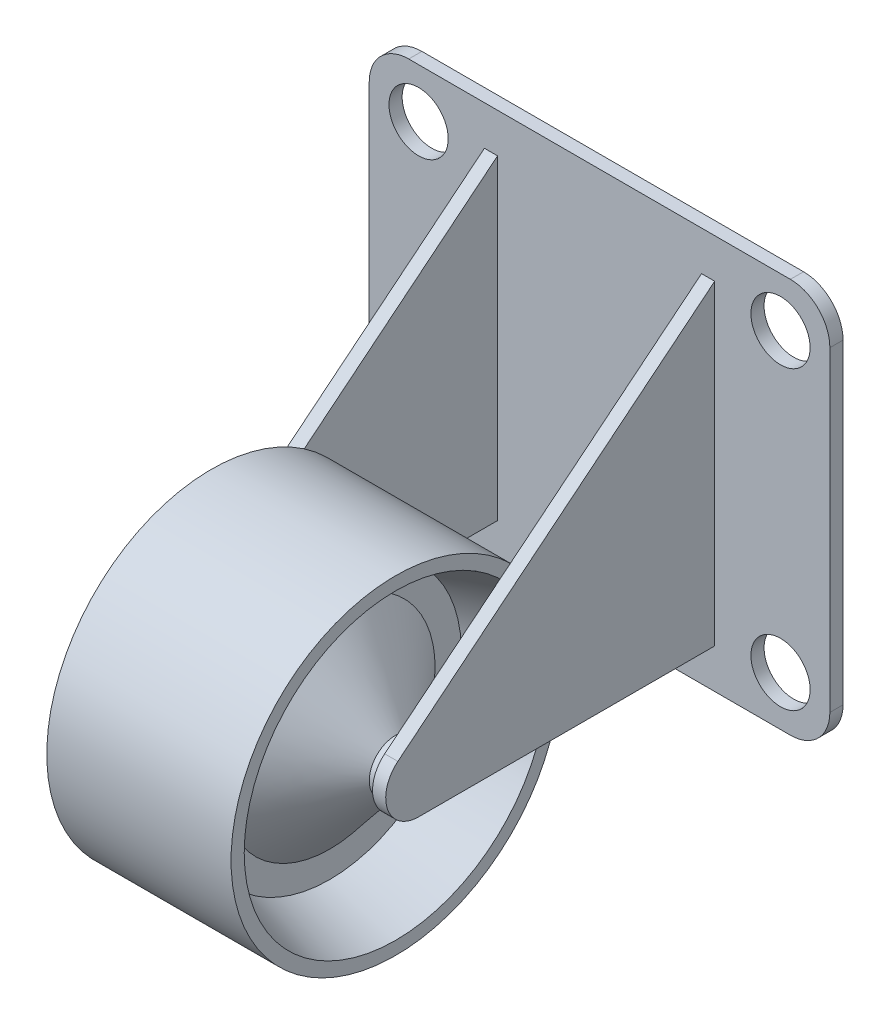
ISO-10303-21;
HEADER;
FILE_DESCRIPTION(('STEP AP214'),'2;1');
FILE_NAME('part.step','',(''),(''),'','','');
FILE_SCHEMA(('AUTOMOTIVE_DESIGN { 1 0 10303 214 1 1 1 1 }'));
ENDSEC;
DATA;
#1=APPLICATION_CONTEXT('core data for automotive mechanical design processes');
#2=APPLICATION_PROTOCOL_DEFINITION('international standard','automotive_design',2000,#1);
#3=PRODUCT_CONTEXT('',#1,'mechanical');
#4=PRODUCT('Part','Part','',(#3));
#5=PRODUCT_RELATED_PRODUCT_CATEGORY('part','',(#4));
#6=PRODUCT_DEFINITION_FORMATION('','',#4);
#7=PRODUCT_DEFINITION_CONTEXT('part definition',#1,'design');
#8=PRODUCT_DEFINITION('design','',#6,#7);
#9=PRODUCT_DEFINITION_SHAPE('','',#8);
#10=(LENGTH_UNIT() NAMED_UNIT(*) SI_UNIT(.MILLI.,.METRE.));
#11=(NAMED_UNIT(*) PLANE_ANGLE_UNIT() SI_UNIT($,.RADIAN.));
#12=(NAMED_UNIT(*) SI_UNIT($,.STERADIAN.) SOLID_ANGLE_UNIT());
#13=UNCERTAINTY_MEASURE_WITH_UNIT(LENGTH_MEASURE(1.E-05),#10,'distance_accuracy_value','');
#14=(GEOMETRIC_REPRESENTATION_CONTEXT(3) GLOBAL_UNCERTAINTY_ASSIGNED_CONTEXT((#13)) GLOBAL_UNIT_ASSIGNED_CONTEXT((#10,
#11,#12)) REPRESENTATION_CONTEXT('',''));
#15=CARTESIAN_POINT('',(0.,0.,0.));
#16=DIRECTION('',(0.,0.,1.));
#17=DIRECTION('',(1.,0.,0.));
#18=AXIS2_PLACEMENT_3D('',#15,#16,#17);
#19=CARTESIAN_POINT('',(-500000.,-24.5,23.5));
#20=DIRECTION('',(1.,0.,0.));
#21=DIRECTION('',(0.,0.,-1.));
#22=AXIS2_PLACEMENT_3D('',#19,#20,#21);
#23=CYLINDRICAL_SURFACE('',#22,2.);
#24=CARTESIAN_POINT('',(9.74999999999682,-24.5,23.5));
#25=DIRECTION('',(1.,0.,0.));
#26=DIRECTION('',(0.,0.,-1.));
#27=AXIS2_PLACEMENT_3D('',#24,#25,#26);
#28=CIRCLE('',#27,2.);
#29=CARTESIAN_POINT('',(9.74999999999682,-24.5,21.5));
#30=VERTEX_POINT('',#29);
#31=EDGE_CURVE('E203',#30,#30,#28,.T.);
#32=ORIENTED_EDGE('',*,*,#31,.T.);
#33=EDGE_LOOP('',(#32));
#34=FACE_BOUND('',#33,.T.);
#35=CARTESIAN_POINT('',(10.4999999999791,-24.5,23.5));
#36=DIRECTION('',(-1.,0.,0.));
#37=DIRECTION('',(0.,-1.,0.));
#38=AXIS2_PLACEMENT_3D('',#35,#36,#37);
#39=CIRCLE('',#38,2.);
#40=CARTESIAN_POINT('',(10.4999999999791,-26.5,23.5));
#41=VERTEX_POINT('',#40);
#42=EDGE_CURVE('E599',#41,#41,#39,.T.);
#43=ORIENTED_EDGE('',*,*,#42,.T.);
#44=EDGE_LOOP('',(#43));
#45=FACE_BOUND('',#44,.T.);
#46=ADVANCED_FACE('F64',(#34,#45),#23,.T.);
#47=CARTESIAN_POINT('',(9.75,-30.,26.));
#48=DIRECTION('',(1.,0.,0.));
#49=DIRECTION('',(0.,0.,-1.));
#50=AXIS2_PLACEMENT_3D('',#47,#48,#49);
#51=PLANE('',#50);
#52=CARTESIAN_POINT('',(9.75,-24.5,23.5));
#53=DIRECTION('',(1.,0.,0.));
#54=DIRECTION('',(0.,0.,-1.));
#55=AXIS2_PLACEMENT_3D('',#52,#53,#54);
#56=CIRCLE('',#55,2.49999999999999);
#57=CARTESIAN_POINT('',(9.75,-22.559619304037,25.0763637761424));
#58=VERTEX_POINT('',#57);
#59=CARTESIAN_POINT('',(9.75,-27.,23.5));
#60=VERTEX_POINT('',#59);
#61=EDGE_CURVE('E232',#58,#60,#56,.T.);
#62=ORIENTED_EDGE('',*,*,#61,.T.);
#63=DIRECTION('',(0.,0.,1.));
#64=VECTOR('',#63,1.);
#65=CARTESIAN_POINT('',(9.75,-27.,26.));
#66=LINE('',#65,#64);
#67=CARTESIAN_POINT('',(9.75,-27.,0.999999999999997));
#68=VERTEX_POINT('',#67);
#69=EDGE_CURVE('E195',#68,#60,#66,.T.);
#70=ORIENTED_EDGE('',*,*,#69,.F.);
#71=DIRECTION('',(0.,1.,0.));
#72=VECTOR('',#71,1.);
#73=CARTESIAN_POINT('',(9.75,-30.,0.999999999999999));
#74=LINE('',#73,#72);
#75=CARTESIAN_POINT('',(9.75,-2.99999999999999,0.999999999999997));
#76=VERTEX_POINT('',#75);
#77=EDGE_CURVE('E68',#68,#76,#74,.T.);
#78=ORIENTED_EDGE('',*,*,#77,.T.);
#79=DIRECTION('',(0.,0.630545510456978,-0.776152278385208));
#80=VECTOR('',#79,1.);
#81=CARTESIAN_POINT('',(9.75,-25.9698496646198,29.2740910143659));
#82=LINE('',#81,#80);
#83=EDGE_CURVE('E226',#58,#76,#82,.T.);
#84=ORIENTED_EDGE('',*,*,#83,.F.);
#85=EDGE_LOOP('',(#62,#70,#78,#84));
#86=FACE_BOUND('',#85,.T.);
#87=ORIENTED_EDGE('',*,*,#31,.F.);
#88=EDGE_LOOP('',(#87));
#89=FACE_BOUND('',#88,.T.);
#90=ADVANCED_FACE('F352',(#86,#89),#51,.T.);
#91=CARTESIAN_POINT('',(25.25,-30.,0.999999999999999));
#92=DIRECTION('',(-1.,0.,0.));
#93=DIRECTION('',(0.,0.,1.));
#94=AXIS2_PLACEMENT_3D('',#91,#92,#93);
#95=PLANE('',#94);
#96=DIRECTION('',(0.,0.,-1.));
#97=VECTOR('',#96,1.);
#98=CARTESIAN_POINT('',(25.25,-27.,1.));
#99=LINE('',#98,#97);
#100=CARTESIAN_POINT('',(25.25,-27.,23.5));
#101=VERTEX_POINT('',#100);
#102=CARTESIAN_POINT('',(25.25,-27.,0.999999999999997));
#103=VERTEX_POINT('',#102);
#104=EDGE_CURVE('E207',#101,#103,#99,.T.);
#105=ORIENTED_EDGE('',*,*,#104,.F.);
#106=CARTESIAN_POINT('',(25.25,-24.5,23.5));
#107=DIRECTION('',(-1.,0.,0.));
#108=DIRECTION('',(0.,0.,1.));
#109=AXIS2_PLACEMENT_3D('',#106,#107,#108);
#110=CIRCLE('',#109,2.49999999999999);
#111=CARTESIAN_POINT('',(25.25,-22.559619304037,25.0763637761424));
#112=VERTEX_POINT('',#111);
#113=EDGE_CURVE('E12',#101,#112,#110,.T.);
#114=ORIENTED_EDGE('',*,*,#113,.T.);
#115=DIRECTION('',(0.,-0.630545510456978,0.776152278385208));
#116=VECTOR('',#115,1.);
#117=CARTESIAN_POINT('',(25.25,-13.7348663004512,14.2137820333022));
#118=LINE('',#117,#116);
#119=CARTESIAN_POINT('',(25.25,-3.,0.999999999999998));
#120=VERTEX_POINT('',#119);
#121=EDGE_CURVE('E74',#120,#112,#118,.T.);
#122=ORIENTED_EDGE('',*,*,#121,.F.);
#123=DIRECTION('',(0.,1.,0.));
#124=VECTOR('',#123,1.);
#125=CARTESIAN_POINT('',(25.25,-30.,0.999999999999999));
#126=LINE('',#125,#124);
#127=EDGE_CURVE('E90',#103,#120,#126,.T.);
#128=ORIENTED_EDGE('',*,*,#127,.F.);
#129=EDGE_LOOP('',(#105,#114,#122,#128));
#130=FACE_BOUND('',#129,.T.);
#131=CARTESIAN_POINT('',(25.25,-24.5,23.5));
#132=DIRECTION('',(-1.,0.,0.));
#133=DIRECTION('',(0.,0.,1.));
#134=AXIS2_PLACEMENT_3D('',#131,#132,#133);
#135=CIRCLE('',#134,2.);
#136=CARTESIAN_POINT('',(25.25,-24.5,25.5));
#137=VERTEX_POINT('',#136);
#138=EDGE_CURVE('E412',#137,#137,#135,.T.);
#139=ORIENTED_EDGE('',*,*,#138,.F.);
#140=EDGE_LOOP('',(#139));
#141=FACE_BOUND('',#140,.T.);
#142=ADVANCED_FACE('F389',(#130,#141),#95,.T.);
#143=CARTESIAN_POINT('',(8.75,-30.,0.999999999999999));
#144=DIRECTION('',(-1.,0.,0.));
#145=DIRECTION('',(0.,0.,1.));
#146=AXIS2_PLACEMENT_3D('',#143,#144,#145);
#147=PLANE('',#146);
#148=DIRECTION('',(0.,0.,-1.));
#149=VECTOR('',#148,1.);
#150=CARTESIAN_POINT('',(8.75,-27.,1.));
#151=LINE('',#150,#149);
#152=CARTESIAN_POINT('',(8.75,-27.,23.5));
#153=VERTEX_POINT('',#152);
#154=CARTESIAN_POINT('',(8.75,-27.,0.999999999999997));
#155=VERTEX_POINT('',#154);
#156=EDGE_CURVE('E210',#153,#155,#151,.T.);
#157=ORIENTED_EDGE('',*,*,#156,.F.);
#158=CARTESIAN_POINT('',(8.75,-24.5,23.5));
#159=DIRECTION('',(-1.,0.,0.));
#160=DIRECTION('',(0.,0.,1.));
#161=AXIS2_PLACEMENT_3D('',#158,#159,#160);
#162=CIRCLE('',#161,2.49999999999999);
#163=CARTESIAN_POINT('',(8.75,-22.559619304037,25.0763637761424));
#164=VERTEX_POINT('',#163);
#165=EDGE_CURVE('E229',#153,#164,#162,.T.);
#166=ORIENTED_EDGE('',*,*,#165,.T.);
#167=DIRECTION('',(0.,-0.630545510456978,0.776152278385208));
#168=VECTOR('',#167,1.);
#169=CARTESIAN_POINT('',(8.75,-13.7348663004512,14.2137820333022));
#170=LINE('',#169,#168);
#171=CARTESIAN_POINT('',(8.75,-3.,0.999999999999999));
#172=VERTEX_POINT('',#171);
#173=EDGE_CURVE('E224',#172,#164,#170,.T.);
#174=ORIENTED_EDGE('',*,*,#173,.F.);
#175=DIRECTION('',(0.,1.,0.));
#176=VECTOR('',#175,1.);
#177=CARTESIAN_POINT('',(8.75,-30.,0.999999999999999));
#178=LINE('',#177,#176);
#179=EDGE_CURVE('E82',#155,#172,#178,.T.);
#180=ORIENTED_EDGE('',*,*,#179,.F.);
#181=EDGE_LOOP('',(#157,#166,#174,#180));
#182=FACE_BOUND('',#181,.T.);
#183=ADVANCED_FACE('F428',(#182),#147,.T.);
#184=CARTESIAN_POINT('',(26.25,-30.,26.));
#185=DIRECTION('',(1.,0.,0.));
#186=DIRECTION('',(0.,0.,-1.));
#187=AXIS2_PLACEMENT_3D('',#184,#185,#186);
#188=PLANE('',#187);
#189=CARTESIAN_POINT('',(26.25,-24.5,23.5));
#190=DIRECTION('',(1.,0.,0.));
#191=DIRECTION('',(0.,0.,-1.));
#192=AXIS2_PLACEMENT_3D('',#189,#190,#191);
#193=CIRCLE('',#192,2.49999999999999);
#194=CARTESIAN_POINT('',(26.25,-22.559619304037,25.0763637761424));
#195=VERTEX_POINT('',#194);
#196=CARTESIAN_POINT('',(26.25,-27.,23.5));
#197=VERTEX_POINT('',#196);
#198=EDGE_CURVE('E185',#195,#197,#193,.T.);
#199=ORIENTED_EDGE('',*,*,#198,.T.);
#200=DIRECTION('',(0.,0.,1.));
#201=VECTOR('',#200,1.);
#202=CARTESIAN_POINT('',(26.25,-27.,0.));
#203=LINE('',#202,#201);
#204=CARTESIAN_POINT('',(26.25,-27.,0.999999999999997));
#205=VERTEX_POINT('',#204);
#206=EDGE_CURVE('E189',#205,#197,#203,.T.);
#207=ORIENTED_EDGE('',*,*,#206,.F.);
#208=DIRECTION('',(0.,1.,0.));
#209=VECTOR('',#208,1.);
#210=CARTESIAN_POINT('',(26.25,-30.,0.999999999999997));
#211=LINE('',#210,#209);
#212=CARTESIAN_POINT('',(26.25,-2.99999999999999,0.999999999999997));
#213=VERTEX_POINT('',#212);
#214=EDGE_CURVE('E234',#205,#213,#211,.T.);
#215=ORIENTED_EDGE('',*,*,#214,.T.);
#216=DIRECTION('',(0.,0.630545510456978,-0.776152278385208));
#217=VECTOR('',#216,1.);
#218=CARTESIAN_POINT('',(26.25,-1.3178377431609,-1.07061036294279));
#219=LINE('',#218,#217);
#220=EDGE_CURVE('E192',#195,#213,#219,.T.);
#221=ORIENTED_EDGE('',*,*,#220,.F.);
#222=EDGE_LOOP('',(#199,#207,#215,#221));
#223=FACE_BOUND('',#222,.T.);
#224=ADVANCED_FACE('F187',(#223),#188,.T.);
#225=CARTESIAN_POINT('',(0.,0.,1.));
#226=DIRECTION('',(1.,0.,0.));
#227=DIRECTION('',(0.,0.,-1.));
#228=AXIS2_PLACEMENT_3D('',#225,#226,#227);
#229=PLANE('',#228);
#230=DIRECTION('',(0.,-1.,0.));
#231=VECTOR('',#230,1.);
#232=CARTESIAN_POINT('',(0.,0.,0.));
#233=LINE('',#232,#231);
#234=CARTESIAN_POINT('',(0.,-3.,0.));
#235=VERTEX_POINT('',#234);
#236=CARTESIAN_POINT('',(0.,-27.,0.));
#237=VERTEX_POINT('',#236);
#238=EDGE_CURVE('E256',#235,#237,#233,.T.);
#239=ORIENTED_EDGE('',*,*,#238,.T.);
#240=DIRECTION('',(0.,0.,-1.));
#241=VECTOR('',#240,1.);
#242=CARTESIAN_POINT('',(0.,-27.,1.));
#243=LINE('',#242,#241);
#244=CARTESIAN_POINT('',(0.,-27.,1.));
#245=VERTEX_POINT('',#244);
#246=EDGE_CURVE('E286',#237,#245,#243,.F.);
#247=ORIENTED_EDGE('',*,*,#246,.T.);
#248=DIRECTION('',(0.,-1.,0.));
#249=VECTOR('',#248,1.);
#250=CARTESIAN_POINT('',(0.,0.,1.));
#251=LINE('',#250,#249);
#252=CARTESIAN_POINT('',(0.,-3.,1.));
#253=VERTEX_POINT('',#252);
#254=EDGE_CURVE('E269',#253,#245,#251,.T.);
#255=ORIENTED_EDGE('',*,*,#254,.F.);
#256=DIRECTION('',(0.,0.,-1.));
#257=VECTOR('',#256,1.);
#258=CARTESIAN_POINT('',(0.,-3.,1.));
#259=LINE('',#258,#257);
#260=EDGE_CURVE('E283',#253,#235,#259,.T.);
#261=ORIENTED_EDGE('',*,*,#260,.T.);
#262=EDGE_LOOP('',(#239,#247,#255,#261));
#263=FACE_BOUND('',#262,.T.);
#264=ADVANCED_FACE('F321',(#263),#229,.F.);
#265=CARTESIAN_POINT('',(0.,-30.,1.));
#266=DIRECTION('',(0.,1.,0.));
#267=DIRECTION('',(0.,0.,1.));
#268=AXIS2_PLACEMENT_3D('',#265,#266,#267);
#269=PLANE('',#268);
#270=DIRECTION('',(0.,0.,-1.));
#271=VECTOR('',#270,1.);
#272=CARTESIAN_POINT('',(32.,-30.,1.));
#273=LINE('',#272,#271);
#274=CARTESIAN_POINT('',(32.,-30.,0.));
#275=VERTEX_POINT('',#274);
#276=CARTESIAN_POINT('',(32.,-30.,1.));
#277=VERTEX_POINT('',#276);
#278=EDGE_CURVE('E248',#275,#277,#273,.F.);
#279=ORIENTED_EDGE('',*,*,#278,.T.);
#280=DIRECTION('',(1.,0.,0.));
#281=VECTOR('',#280,1.);
#282=CARTESIAN_POINT('',(0.,-30.,1.));
#283=LINE('',#282,#281);
#284=CARTESIAN_POINT('',(3.,-30.,1.));
#285=VERTEX_POINT('',#284);
#286=EDGE_CURVE('E250',#285,#277,#283,.T.);
#287=ORIENTED_EDGE('',*,*,#286,.F.);
#288=DIRECTION('',(0.,0.,-1.));
#289=VECTOR('',#288,1.);
#290=CARTESIAN_POINT('',(3.,-30.,1.));
#291=LINE('',#290,#289);
#292=CARTESIAN_POINT('',(3.,-30.,0.));
#293=VERTEX_POINT('',#292);
#294=EDGE_CURVE('E272',#285,#293,#291,.T.);
#295=ORIENTED_EDGE('',*,*,#294,.T.);
#296=DIRECTION('',(1.,0.,0.));
#297=VECTOR('',#296,1.);
#298=CARTESIAN_POINT('',(0.,-30.,0.));
#299=LINE('',#298,#297);
#300=EDGE_CURVE('E259',#293,#275,#299,.T.);
#301=ORIENTED_EDGE('',*,*,#300,.T.);
#302=EDGE_LOOP('',(#279,#287,#295,#301));
#303=FACE_BOUND('',#302,.T.);
#304=ADVANCED_FACE('F660',(#303),#269,.F.);
#305=CARTESIAN_POINT('',(35.,0.,1.));
#306=DIRECTION('',(-1.,0.,0.));
#307=DIRECTION('',(0.,-1.,0.));
#308=AXIS2_PLACEMENT_3D('',#305,#306,#307);
#309=PLANE('',#308);
#310=DIRECTION('',(0.,1.,0.));
#311=VECTOR('',#310,1.);
#312=CARTESIAN_POINT('',(35.,0.,1.));
#313=LINE('',#312,#311);
#314=CARTESIAN_POINT('',(35.,-27.,1.));
#315=VERTEX_POINT('',#314);
#316=CARTESIAN_POINT('',(35.,-3.,1.));
#317=VERTEX_POINT('',#316);
#318=EDGE_CURVE('E249',#315,#317,#313,.T.);
#319=ORIENTED_EDGE('',*,*,#318,.F.);
#320=DIRECTION('',(0.,0.,-1.));
#321=VECTOR('',#320,1.);
#322=CARTESIAN_POINT('',(35.,-27.,1.));
#323=LINE('',#322,#321);
#324=CARTESIAN_POINT('',(35.,-27.,0.));
#325=VERTEX_POINT('',#324);
#326=EDGE_CURVE('E298',#315,#325,#323,.T.);
#327=ORIENTED_EDGE('',*,*,#326,.T.);
#328=DIRECTION('',(0.,1.,0.));
#329=VECTOR('',#328,1.);
#330=CARTESIAN_POINT('',(35.,0.,0.));
#331=LINE('',#330,#329);
#332=CARTESIAN_POINT('',(35.,-3.,0.));
#333=VERTEX_POINT('',#332);
#334=EDGE_CURVE('E263',#325,#333,#331,.T.);
#335=ORIENTED_EDGE('',*,*,#334,.T.);
#336=DIRECTION('',(0.,0.,-1.));
#337=VECTOR('',#336,1.);
#338=CARTESIAN_POINT('',(35.,-3.,1.));
#339=LINE('',#338,#337);
#340=EDGE_CURVE('E296',#333,#317,#339,.F.);
#341=ORIENTED_EDGE('',*,*,#340,.T.);
#342=EDGE_LOOP('',(#319,#327,#335,#341));
#343=FACE_BOUND('',#342,.T.);
#344=ADVANCED_FACE('F691',(#343),#309,.F.);
#345=CARTESIAN_POINT('',(0.,0.,1.));
#346=DIRECTION('',(0.,-1.,0.));
#347=DIRECTION('',(0.,0.,-1.));
#348=AXIS2_PLACEMENT_3D('',#345,#346,#347);
#349=PLANE('',#348);
#350=DIRECTION('',(0.,0.,-1.));
#351=VECTOR('',#350,1.);
#352=CARTESIAN_POINT('',(3.,0.,1.));
#353=LINE('',#352,#351);
#354=CARTESIAN_POINT('',(3.,0.,0.));
#355=VERTEX_POINT('',#354);
#356=CARTESIAN_POINT('',(3.,0.,1.));
#357=VERTEX_POINT('',#356);
#358=EDGE_CURVE('E244',#355,#357,#353,.F.);
#359=ORIENTED_EDGE('',*,*,#358,.T.);
#360=DIRECTION('',(-1.,0.,0.));
#361=VECTOR('',#360,1.);
#362=CARTESIAN_POINT('',(0.,0.,1.));
#363=LINE('',#362,#361);
#364=CARTESIAN_POINT('',(32.,0.,1.));
#365=VERTEX_POINT('',#364);
#366=EDGE_CURVE('E245',#365,#357,#363,.T.);
#367=ORIENTED_EDGE('',*,*,#366,.F.);
#368=DIRECTION('',(0.,0.,-1.));
#369=VECTOR('',#368,1.);
#370=CARTESIAN_POINT('',(32.,0.,1.));
#371=LINE('',#370,#369);
#372=CARTESIAN_POINT('',(32.,0.,0.));
#373=VERTEX_POINT('',#372);
#374=EDGE_CURVE('E301',#365,#373,#371,.T.);
#375=ORIENTED_EDGE('',*,*,#374,.T.);
#376=DIRECTION('',(-1.,0.,0.));
#377=VECTOR('',#376,1.);
#378=CARTESIAN_POINT('',(0.,0.,0.));
#379=LINE('',#378,#377);
#380=EDGE_CURVE('E266',#373,#355,#379,.T.);
#381=ORIENTED_EDGE('',*,*,#380,.T.);
#382=EDGE_LOOP('',(#359,#367,#375,#381));
#383=FACE_BOUND('',#382,.T.);
#384=ADVANCED_FACE('F308',(#383),#349,.F.);
#385=CARTESIAN_POINT('',(0.,0.,1.));
#386=DIRECTION('',(0.,0.,1.));
#387=DIRECTION('',(1.,0.,0.));
#388=AXIS2_PLACEMENT_3D('',#385,#386,#387);
#389=PLANE('',#388);
#390=ORIENTED_EDGE('',*,*,#77,.F.);
#391=DIRECTION('',(1.,0.,0.));
#392=VECTOR('',#391,1.);
#393=CARTESIAN_POINT('',(0.,-27.,0.999999999999997));
#394=LINE('',#393,#392);
#395=EDGE_CURVE('E208',#155,#68,#394,.T.);
#396=ORIENTED_EDGE('',*,*,#395,.F.);
#397=ORIENTED_EDGE('',*,*,#179,.T.);
#398=DIRECTION('',(1.,0.,0.));
#399=VECTOR('',#398,1.);
#400=CARTESIAN_POINT('',(0.,-2.99999999999999,0.999999999999997));
#401=LINE('',#400,#399);
#402=EDGE_CURVE('E221',#172,#76,#401,.T.);
#403=ORIENTED_EDGE('',*,*,#402,.T.);
#404=EDGE_LOOP('',(#390,#396,#397,#403));
#405=FACE_BOUND('',#404,.T.);
#406=EDGE_CURVE('E206',#103,#205,#394,.T.);
#407=ORIENTED_EDGE('',*,*,#406,.F.);
#408=ORIENTED_EDGE('',*,*,#127,.T.);
#409=EDGE_CURVE('E219',#120,#213,#401,.T.);
#410=ORIENTED_EDGE('',*,*,#409,.T.);
#411=ORIENTED_EDGE('',*,*,#214,.F.);
#412=EDGE_LOOP('',(#407,#408,#410,#411));
#413=FACE_BOUND('',#412,.T.);
#414=CARTESIAN_POINT('',(3.75,-26.25,1.));
#415=DIRECTION('',(0.,0.,1.));
#416=DIRECTION('',(1.,0.,0.));
#417=AXIS2_PLACEMENT_3D('',#414,#415,#416);
#418=CIRCLE('',#417,2.25);
#419=CARTESIAN_POINT('',(6.,-26.25,1.));
#420=VERTEX_POINT('',#419);
#421=EDGE_CURVE('E339',#420,#420,#418,.T.);
#422=ORIENTED_EDGE('',*,*,#421,.F.);
#423=EDGE_LOOP('',(#422));
#424=FACE_BOUND('',#423,.T.);
#425=ORIENTED_EDGE('',*,*,#286,.T.);
#426=CARTESIAN_POINT('',(32.,-27.,1.));
#427=DIRECTION('',(0.,0.,1.));
#428=DIRECTION('',(1.,0.,0.));
#429=AXIS2_PLACEMENT_3D('',#426,#427,#428);
#430=CIRCLE('',#429,3.);
#431=EDGE_CURVE('E292',#277,#315,#430,.T.);
#432=ORIENTED_EDGE('',*,*,#431,.T.);
#433=ORIENTED_EDGE('',*,*,#318,.T.);
#434=CARTESIAN_POINT('',(32.,-3.,1.));
#435=DIRECTION('',(0.,0.,1.));
#436=DIRECTION('',(1.,0.,0.));
#437=AXIS2_PLACEMENT_3D('',#434,#435,#436);
#438=CIRCLE('',#437,3.);
#439=EDGE_CURVE('E288',#317,#365,#438,.T.);
#440=ORIENTED_EDGE('',*,*,#439,.T.);
#441=ORIENTED_EDGE('',*,*,#366,.T.);
#442=CARTESIAN_POINT('',(3.,-3.,1.));
#443=DIRECTION('',(0.,0.,1.));
#444=DIRECTION('',(1.,0.,0.));
#445=AXIS2_PLACEMENT_3D('',#442,#443,#444);
#446=CIRCLE('',#445,3.);
#447=EDGE_CURVE('E290',#357,#253,#446,.T.);
#448=ORIENTED_EDGE('',*,*,#447,.T.);
#449=ORIENTED_EDGE('',*,*,#254,.T.);
#450=CARTESIAN_POINT('',(3.,-27.,1.));
#451=DIRECTION('',(0.,0.,1.));
#452=DIRECTION('',(1.,0.,0.));
#453=AXIS2_PLACEMENT_3D('',#450,#451,#452);
#454=CIRCLE('',#453,3.);
#455=EDGE_CURVE('E294',#245,#285,#454,.T.);
#456=ORIENTED_EDGE('',*,*,#455,.T.);
#457=EDGE_LOOP('',(#425,#432,#433,#440,#441,#448,#449,#456));
#458=FACE_BOUND('',#457,.T.);
#459=CARTESIAN_POINT('',(3.75,-3.75,1.));
#460=DIRECTION('',(0.,0.,1.));
#461=DIRECTION('',(1.,0.,0.));
#462=AXIS2_PLACEMENT_3D('',#459,#460,#461);
#463=CIRCLE('',#462,2.25);
#464=CARTESIAN_POINT('',(6.,-3.75,1.));
#465=VERTEX_POINT('',#464);
#466=EDGE_CURVE('E343',#465,#465,#463,.T.);
#467=ORIENTED_EDGE('',*,*,#466,.F.);
#468=EDGE_LOOP('',(#467));
#469=FACE_BOUND('',#468,.T.);
#470=CARTESIAN_POINT('',(31.25,-3.74999999999999,1.));
#471=DIRECTION('',(0.,0.,1.));
#472=DIRECTION('',(1.,0.,0.));
#473=AXIS2_PLACEMENT_3D('',#470,#471,#472);
#474=CIRCLE('',#473,2.25000000000001);
#475=CARTESIAN_POINT('',(33.5,-3.74999999999999,1.));
#476=VERTEX_POINT('',#475);
#477=EDGE_CURVE('E326',#476,#476,#474,.T.);
#478=ORIENTED_EDGE('',*,*,#477,.F.);
#479=EDGE_LOOP('',(#478));
#480=FACE_BOUND('',#479,.T.);
#481=CARTESIAN_POINT('',(31.25,-26.25,1.));
#482=DIRECTION('',(0.,0.,1.));
#483=DIRECTION('',(1.,0.,0.));
#484=AXIS2_PLACEMENT_3D('',#481,#482,#483);
#485=CIRCLE('',#484,2.25);
#486=CARTESIAN_POINT('',(33.5,-26.25,1.));
#487=VERTEX_POINT('',#486);
#488=EDGE_CURVE('E333',#487,#487,#485,.T.);
#489=ORIENTED_EDGE('',*,*,#488,.F.);
#490=EDGE_LOOP('',(#489));
#491=FACE_BOUND('',#490,.T.);
#492=ADVANCED_FACE('F317',(#405,#413,#424,#458,#469,#480,#491),#389,.T.);
#493=CARTESIAN_POINT('',(0.,0.,0.));
#494=DIRECTION('',(0.,0.,1.));
#495=DIRECTION('',(1.,0.,0.));
#496=AXIS2_PLACEMENT_3D('',#493,#494,#495);
#497=PLANE('',#496);
#498=CARTESIAN_POINT('',(3.75,-3.75,0.));
#499=DIRECTION('',(0.,0.,1.));
#500=DIRECTION('',(1.,0.,0.));
#501=AXIS2_PLACEMENT_3D('',#498,#499,#500);
#502=CIRCLE('',#501,2.25);
#503=CARTESIAN_POINT('',(6.,-3.75,0.));
#504=VERTEX_POINT('',#503);
#505=EDGE_CURVE('E240',#504,#504,#502,.T.);
#506=ORIENTED_EDGE('',*,*,#505,.T.);
#507=EDGE_LOOP('',(#506));
#508=FACE_BOUND('',#507,.T.);
#509=CARTESIAN_POINT('',(3.75,-26.25,0.));
#510=DIRECTION('',(0.,0.,1.));
#511=DIRECTION('',(1.,0.,0.));
#512=AXIS2_PLACEMENT_3D('',#509,#510,#511);
#513=CIRCLE('',#512,2.25);
#514=CARTESIAN_POINT('',(6.,-26.25,0.));
#515=VERTEX_POINT('',#514);
#516=EDGE_CURVE('E336',#515,#515,#513,.T.);
#517=ORIENTED_EDGE('',*,*,#516,.T.);
#518=EDGE_LOOP('',(#517));
#519=FACE_BOUND('',#518,.T.);
#520=CARTESIAN_POINT('',(31.25,-26.25,0.));
#521=DIRECTION('',(0.,0.,1.));
#522=DIRECTION('',(1.,0.,0.));
#523=AXIS2_PLACEMENT_3D('',#520,#521,#522);
#524=CIRCLE('',#523,2.25);
#525=CARTESIAN_POINT('',(33.5,-26.25,0.));
#526=VERTEX_POINT('',#525);
#527=EDGE_CURVE('E330',#526,#526,#524,.T.);
#528=ORIENTED_EDGE('',*,*,#527,.T.);
#529=EDGE_LOOP('',(#528));
#530=FACE_BOUND('',#529,.T.);
#531=CARTESIAN_POINT('',(31.25,-3.74999999999999,0.));
#532=DIRECTION('',(0.,0.,1.));
#533=DIRECTION('',(1.,0.,0.));
#534=AXIS2_PLACEMENT_3D('',#531,#532,#533);
#535=CIRCLE('',#534,2.25000000000001);
#536=CARTESIAN_POINT('',(33.5,-3.74999999999999,0.));
#537=VERTEX_POINT('',#536);
#538=EDGE_CURVE('E260',#537,#537,#535,.T.);
#539=ORIENTED_EDGE('',*,*,#538,.T.);
#540=EDGE_LOOP('',(#539));
#541=FACE_BOUND('',#540,.T.);
#542=ORIENTED_EDGE('',*,*,#300,.F.);
#543=CARTESIAN_POINT('',(3.,-27.,0.));
#544=DIRECTION('',(0.,0.,1.));
#545=DIRECTION('',(1.,0.,0.));
#546=AXIS2_PLACEMENT_3D('',#543,#544,#545);
#547=CIRCLE('',#546,3.);
#548=EDGE_CURVE('E281',#293,#237,#547,.F.);
#549=ORIENTED_EDGE('',*,*,#548,.T.);
#550=ORIENTED_EDGE('',*,*,#238,.F.);
#551=CARTESIAN_POINT('',(3.,-3.,0.));
#552=DIRECTION('',(0.,0.,1.));
#553=DIRECTION('',(1.,0.,0.));
#554=AXIS2_PLACEMENT_3D('',#551,#552,#553);
#555=CIRCLE('',#554,3.);
#556=EDGE_CURVE('E277',#235,#355,#555,.F.);
#557=ORIENTED_EDGE('',*,*,#556,.T.);
#558=ORIENTED_EDGE('',*,*,#380,.F.);
#559=CARTESIAN_POINT('',(32.,-3.,0.));
#560=DIRECTION('',(0.,0.,1.));
#561=DIRECTION('',(1.,0.,0.));
#562=AXIS2_PLACEMENT_3D('',#559,#560,#561);
#563=CIRCLE('',#562,3.);
#564=EDGE_CURVE('E275',#373,#333,#563,.F.);
#565=ORIENTED_EDGE('',*,*,#564,.T.);
#566=ORIENTED_EDGE('',*,*,#334,.F.);
#567=CARTESIAN_POINT('',(32.,-27.,0.));
#568=DIRECTION('',(0.,0.,1.));
#569=DIRECTION('',(1.,0.,0.));
#570=AXIS2_PLACEMENT_3D('',#567,#568,#569);
#571=CIRCLE('',#570,3.);
#572=EDGE_CURVE('E279',#325,#275,#571,.F.);
#573=ORIENTED_EDGE('',*,*,#572,.T.);
#574=EDGE_LOOP('',(#542,#549,#550,#557,#558,#565,#566,#573));
#575=FACE_BOUND('',#574,.T.);
#576=ADVANCED_FACE('F360',(#508,#519,#530,#541,#575),#497,.F.);
#577=CARTESIAN_POINT('',(3.,-27.,1.));
#578=DIRECTION('',(0.,0.,-1.));
#579=DIRECTION('',(-1.,0.,0.));
#580=AXIS2_PLACEMENT_3D('',#577,#578,#579);
#581=CYLINDRICAL_SURFACE('',#580,3.);
#582=ORIENTED_EDGE('',*,*,#455,.F.);
#583=ORIENTED_EDGE('',*,*,#246,.F.);
#584=ORIENTED_EDGE('',*,*,#548,.F.);
#585=ORIENTED_EDGE('',*,*,#294,.F.);
#586=EDGE_LOOP('',(#582,#583,#584,#585));
#587=FACE_BOUND('',#586,.T.);
#588=ADVANCED_FACE('F667',(#587),#581,.T.);
#589=CARTESIAN_POINT('',(32.,-27.,1.));
#590=DIRECTION('',(0.,0.,-1.));
#591=DIRECTION('',(-1.,0.,0.));
#592=AXIS2_PLACEMENT_3D('',#589,#590,#591);
#593=CYLINDRICAL_SURFACE('',#592,3.);
#594=ORIENTED_EDGE('',*,*,#431,.F.);
#595=ORIENTED_EDGE('',*,*,#278,.F.);
#596=ORIENTED_EDGE('',*,*,#572,.F.);
#597=ORIENTED_EDGE('',*,*,#326,.F.);
#598=EDGE_LOOP('',(#594,#595,#596,#597));
#599=FACE_BOUND('',#598,.T.);
#600=ADVANCED_FACE('F648',(#599),#593,.T.);
#601=CARTESIAN_POINT('',(3.,-3.,1.));
#602=DIRECTION('',(0.,0.,-1.));
#603=DIRECTION('',(-1.,0.,0.));
#604=AXIS2_PLACEMENT_3D('',#601,#602,#603);
#605=CYLINDRICAL_SURFACE('',#604,3.);
#606=ORIENTED_EDGE('',*,*,#447,.F.);
#607=ORIENTED_EDGE('',*,*,#358,.F.);
#608=ORIENTED_EDGE('',*,*,#556,.F.);
#609=ORIENTED_EDGE('',*,*,#260,.F.);
#610=EDGE_LOOP('',(#606,#607,#608,#609));
#611=FACE_BOUND('',#610,.T.);
#612=ADVANCED_FACE('F313',(#611),#605,.T.);
#613=CARTESIAN_POINT('',(32.,-3.,1.));
#614=DIRECTION('',(0.,0.,-1.));
#615=DIRECTION('',(-1.,0.,0.));
#616=AXIS2_PLACEMENT_3D('',#613,#614,#615);
#617=CYLINDRICAL_SURFACE('',#616,3.);
#618=ORIENTED_EDGE('',*,*,#439,.F.);
#619=ORIENTED_EDGE('',*,*,#340,.F.);
#620=ORIENTED_EDGE('',*,*,#564,.F.);
#621=ORIENTED_EDGE('',*,*,#374,.F.);
#622=EDGE_LOOP('',(#618,#619,#620,#621));
#623=FACE_BOUND('',#622,.T.);
#624=ADVANCED_FACE('F66',(#623),#617,.T.);
#625=CARTESIAN_POINT('',(31.25,-3.74999999999999,0.));
#626=DIRECTION('',(0.,0.,1.));
#627=DIRECTION('',(1.,0.,0.));
#628=AXIS2_PLACEMENT_3D('',#625,#626,#627);
#629=CYLINDRICAL_SURFACE('',#628,2.25000000000001);
#630=ORIENTED_EDGE('',*,*,#538,.F.);
#631=EDGE_LOOP('',(#630));
#632=FACE_BOUND('',#631,.T.);
#633=ORIENTED_EDGE('',*,*,#477,.T.);
#634=EDGE_LOOP('',(#633));
#635=FACE_BOUND('',#634,.T.);
#636=ADVANCED_FACE('F378',(#632,#635),#629,.F.);
#637=CARTESIAN_POINT('',(31.25,-26.25,0.));
#638=DIRECTION('',(0.,0.,1.));
#639=DIRECTION('',(1.,0.,0.));
#640=AXIS2_PLACEMENT_3D('',#637,#638,#639);
#641=CYLINDRICAL_SURFACE('',#640,2.25);
#642=ORIENTED_EDGE('',*,*,#527,.F.);
#643=EDGE_LOOP('',(#642));
#644=FACE_BOUND('',#643,.T.);
#645=ORIENTED_EDGE('',*,*,#488,.T.);
#646=EDGE_LOOP('',(#645));
#647=FACE_BOUND('',#646,.T.);
#648=ADVANCED_FACE('F368',(#644,#647),#641,.F.);
#649=CARTESIAN_POINT('',(3.75,-26.25,0.));
#650=DIRECTION('',(0.,0.,1.));
#651=DIRECTION('',(1.,0.,0.));
#652=AXIS2_PLACEMENT_3D('',#649,#650,#651);
#653=CYLINDRICAL_SURFACE('',#652,2.25);
#654=ORIENTED_EDGE('',*,*,#516,.F.);
#655=EDGE_LOOP('',(#654));
#656=FACE_BOUND('',#655,.T.);
#657=ORIENTED_EDGE('',*,*,#421,.T.);
#658=EDGE_LOOP('',(#657));
#659=FACE_BOUND('',#658,.T.);
#660=ADVANCED_FACE('F365',(#656,#659),#653,.F.);
#661=CARTESIAN_POINT('',(3.75,-3.75,0.));
#662=DIRECTION('',(0.,0.,1.));
#663=DIRECTION('',(1.,0.,0.));
#664=AXIS2_PLACEMENT_3D('',#661,#662,#663);
#665=CYLINDRICAL_SURFACE('',#664,2.25);
#666=ORIENTED_EDGE('',*,*,#505,.F.);
#667=EDGE_LOOP('',(#666));
#668=FACE_BOUND('',#667,.T.);
#669=ORIENTED_EDGE('',*,*,#466,.T.);
#670=EDGE_LOOP('',(#669));
#671=FACE_BOUND('',#670,.T.);
#672=ADVANCED_FACE('F367',(#668,#671),#665,.F.);
#673=CARTESIAN_POINT('',(0.,-1.3178377431609,-1.07061036294279));
#674=DIRECTION('',(0.,-0.776152278385208,-0.630545510456978));
#675=DIRECTION('',(0.,0.630545510456978,-0.776152278385208));
#676=AXIS2_PLACEMENT_3D('',#673,#674,#675);
#677=PLANE('',#676);
#678=ORIENTED_EDGE('',*,*,#121,.T.);
#679=DIRECTION('',(1.,0.,0.));
#680=VECTOR('',#679,1.);
#681=CARTESIAN_POINT('',(0.,-22.559619304037,25.0763637761424));
#682=LINE('',#681,#680);
#683=EDGE_CURVE('E218',#112,#195,#682,.T.);
#684=ORIENTED_EDGE('',*,*,#683,.T.);
#685=ORIENTED_EDGE('',*,*,#220,.T.);
#686=ORIENTED_EDGE('',*,*,#409,.F.);
#687=EDGE_LOOP('',(#678,#684,#685,#686));
#688=FACE_BOUND('',#687,.T.);
#689=ADVANCED_FACE('F375',(#688),#677,.F.);
#690=CARTESIAN_POINT('',(0.,-24.5,23.5));
#691=DIRECTION('',(1.,0.,0.));
#692=DIRECTION('',(0.,0.,-1.));
#693=AXIS2_PLACEMENT_3D('',#690,#691,#692);
#694=CYLINDRICAL_SURFACE('',#693,2.49999999999999);
#695=ORIENTED_EDGE('',*,*,#113,.F.);
#696=DIRECTION('',(1.,0.,0.));
#697=VECTOR('',#696,1.);
#698=CARTESIAN_POINT('',(0.,-27.,23.5));
#699=LINE('',#698,#697);
#700=EDGE_CURVE('E198',#101,#197,#699,.T.);
#701=ORIENTED_EDGE('',*,*,#700,.T.);
#702=ORIENTED_EDGE('',*,*,#198,.F.);
#703=ORIENTED_EDGE('',*,*,#683,.F.);
#704=EDGE_LOOP('',(#695,#701,#702,#703));
#705=FACE_BOUND('',#704,.T.);
#706=ADVANCED_FACE('F199',(#705),#694,.T.);
#707=EDGE_CURVE('E222',#164,#58,#682,.T.);
#708=ORIENTED_EDGE('',*,*,#707,.F.);
#709=ORIENTED_EDGE('',*,*,#165,.F.);
#710=EDGE_CURVE('E202',#153,#60,#699,.T.);
#711=ORIENTED_EDGE('',*,*,#710,.T.);
#712=ORIENTED_EDGE('',*,*,#61,.F.);
#713=EDGE_LOOP('',(#708,#709,#711,#712));
#714=FACE_BOUND('',#713,.T.);
#715=ADVANCED_FACE('F424',(#714),#694,.T.);
#716=ORIENTED_EDGE('',*,*,#83,.T.);
#717=ORIENTED_EDGE('',*,*,#402,.F.);
#718=ORIENTED_EDGE('',*,*,#173,.T.);
#719=ORIENTED_EDGE('',*,*,#707,.T.);
#720=EDGE_LOOP('',(#716,#717,#718,#719));
#721=FACE_BOUND('',#720,.T.);
#722=ADVANCED_FACE('F356',(#721),#677,.F.);
#723=CARTESIAN_POINT('',(0.,-27.,0.));
#724=DIRECTION('',(0.,1.,0.));
#725=DIRECTION('',(0.,0.,1.));
#726=AXIS2_PLACEMENT_3D('',#723,#724,#725);
#727=PLANE('',#726);
#728=ORIENTED_EDGE('',*,*,#69,.T.);
#729=ORIENTED_EDGE('',*,*,#710,.F.);
#730=ORIENTED_EDGE('',*,*,#156,.T.);
#731=ORIENTED_EDGE('',*,*,#395,.T.);
#732=EDGE_LOOP('',(#728,#729,#730,#731));
#733=FACE_BOUND('',#732,.T.);
#734=ADVANCED_FACE('F405',(#733),#727,.F.);
#735=ORIENTED_EDGE('',*,*,#104,.T.);
#736=ORIENTED_EDGE('',*,*,#406,.T.);
#737=ORIENTED_EDGE('',*,*,#206,.T.);
#738=ORIENTED_EDGE('',*,*,#700,.F.);
#739=EDGE_LOOP('',(#735,#736,#737,#738));
#740=FACE_BOUND('',#739,.T.);
#741=ADVANCED_FACE('F205',(#740),#727,.F.);
#742=CARTESIAN_POINT('',(24.4999999999891,-24.5,23.5));
#743=DIRECTION('',(-1.,0.,0.));
#744=DIRECTION('',(0.,-1.,0.));
#745=AXIS2_PLACEMENT_3D('',#742,#743,#744);
#746=CIRCLE('',#745,2.00000000000001);
#747=CARTESIAN_POINT('',(24.4999999999891,-26.5,23.5));
#748=VERTEX_POINT('',#747);
#749=EDGE_CURVE('E409',#748,#748,#746,.T.);
#750=ORIENTED_EDGE('',*,*,#749,.F.);
#751=EDGE_LOOP('',(#750));
#752=FACE_BOUND('',#751,.T.);
#753=ORIENTED_EDGE('',*,*,#138,.T.);
#754=EDGE_LOOP('',(#753));
#755=FACE_BOUND('',#754,.T.);
#756=ADVANCED_FACE('F385',(#752,#755),#23,.T.);
#757=CARTESIAN_POINT('',(24.5,-24.5,23.5));
#758=DIRECTION('',(1.,0.,0.));
#759=DIRECTION('',(0.,0.,-1.));
#760=AXIS2_PLACEMENT_3D('',#757,#758,#759);
#761=PLANE('',#760);
#762=CARTESIAN_POINT('',(24.5,-24.5,23.5));
#763=DIRECTION('',(-1.,0.,0.));
#764=DIRECTION('',(0.,-1.,0.));
#765=AXIS2_PLACEMENT_3D('',#762,#763,#764);
#766=CIRCLE('',#765,11.5);
#767=CARTESIAN_POINT('',(24.5,-36.,23.5));
#768=VERTEX_POINT('',#767);
#769=EDGE_CURVE('E619',#768,#768,#766,.T.);
#770=ORIENTED_EDGE('',*,*,#769,.T.);
#771=EDGE_LOOP('',(#770));
#772=FACE_BOUND('',#771,.T.);
#773=CARTESIAN_POINT('',(24.5,-24.5,23.5));
#774=DIRECTION('',(1.,0.,0.));
#775=DIRECTION('',(0.,0.,-1.));
#776=AXIS2_PLACEMENT_3D('',#773,#774,#775);
#777=CIRCLE('',#776,12.5);
#778=CARTESIAN_POINT('',(24.5,-24.5,11.));
#779=VERTEX_POINT('',#778);
#780=EDGE_CURVE('E414',#779,#779,#777,.T.);
#781=ORIENTED_EDGE('',*,*,#780,.T.);
#782=EDGE_LOOP('',(#781));
#783=FACE_BOUND('',#782,.T.);
#784=ADVANCED_FACE('F396',(#772,#783),#761,.T.);
#785=CARTESIAN_POINT('',(10.5,-24.5,23.5));
#786=DIRECTION('',(1.,0.,0.));
#787=DIRECTION('',(0.,0.,-1.));
#788=AXIS2_PLACEMENT_3D('',#785,#786,#787);
#789=PLANE('',#788);
#790=CARTESIAN_POINT('',(10.5,-24.5,23.5));
#791=DIRECTION('',(-1.,0.,0.));
#792=DIRECTION('',(0.,-1.,0.));
#793=AXIS2_PLACEMENT_3D('',#790,#791,#792);
#794=CIRCLE('',#793,11.5);
#795=CARTESIAN_POINT('',(10.5,-36.,23.5));
#796=VERTEX_POINT('',#795);
#797=EDGE_CURVE('E606',#796,#796,#794,.T.);
#798=ORIENTED_EDGE('',*,*,#797,.F.);
#799=EDGE_LOOP('',(#798));
#800=FACE_BOUND('',#799,.T.);
#801=CARTESIAN_POINT('',(10.5,-24.5,23.5));
#802=DIRECTION('',(1.,0.,0.));
#803=DIRECTION('',(0.,0.,-1.));
#804=AXIS2_PLACEMENT_3D('',#801,#802,#803);
#805=CIRCLE('',#804,12.5);
#806=CARTESIAN_POINT('',(10.5,-24.5,11.));
#807=VERTEX_POINT('',#806);
#808=EDGE_CURVE('E418',#807,#807,#805,.T.);
#809=ORIENTED_EDGE('',*,*,#808,.F.);
#810=EDGE_LOOP('',(#809));
#811=FACE_BOUND('',#810,.T.);
#812=ADVANCED_FACE('F402',(#800,#811),#789,.F.);
#813=CARTESIAN_POINT('',(24.5,-24.5,23.5));
#814=DIRECTION('',(-1.,0.,0.));
#815=DIRECTION('',(0.,0.,1.));
#816=AXIS2_PLACEMENT_3D('',#813,#814,#815);
#817=CYLINDRICAL_SURFACE('',#816,12.5);
#818=ORIENTED_EDGE('',*,*,#780,.F.);
#819=EDGE_LOOP('',(#818));
#820=FACE_BOUND('',#819,.T.);
#821=ORIENTED_EDGE('',*,*,#808,.T.);
#822=EDGE_LOOP('',(#821));
#823=FACE_BOUND('',#822,.T.);
#824=ADVANCED_FACE('F514',(#820,#823),#817,.T.);
#825=CARTESIAN_POINT('',(19.5,-24.5,23.5));
#826=DIRECTION('',(1.,0.,0.));
#827=DIRECTION('',(0.,1.,0.));
#828=AXIS2_PLACEMENT_3D('',#825,#826,#827);
#829=CONICAL_SURFACE('',#828,10.,0.291456794477868);
#830=ORIENTED_EDGE('',*,*,#769,.F.);
#831=EDGE_LOOP('',(#830));
#832=FACE_BOUND('',#831,.T.);
#833=CARTESIAN_POINT('',(19.5,-24.5,23.5));
#834=DIRECTION('',(-1.,0.,0.));
#835=DIRECTION('',(0.,-1.,0.));
#836=AXIS2_PLACEMENT_3D('',#833,#834,#835);
#837=CIRCLE('',#836,10.);
#838=CARTESIAN_POINT('',(19.5,-34.5,23.5));
#839=VERTEX_POINT('',#838);
#840=EDGE_CURVE('E616',#839,#839,#837,.T.);
#841=ORIENTED_EDGE('',*,*,#840,.T.);
#842=EDGE_LOOP('',(#841));
#843=FACE_BOUND('',#842,.T.);
#844=ADVANCED_FACE('F519',(#832,#843),#829,.F.);
#845=CARTESIAN_POINT('',(19.5,-14.5,23.5));
#846=DIRECTION('',(-1.,0.,0.));
#847=DIRECTION('',(0.,-1.,0.));
#848=AXIS2_PLACEMENT_3D('',#845,#846,#847);
#849=PLANE('',#848);
#850=ORIENTED_EDGE('',*,*,#840,.F.);
#851=EDGE_LOOP('',(#850));
#852=FACE_BOUND('',#851,.T.);
#853=CARTESIAN_POINT('',(19.5,-24.5,23.5));
#854=DIRECTION('',(-1.,0.,0.));
#855=DIRECTION('',(0.,-1.,0.));
#856=AXIS2_PLACEMENT_3D('',#853,#854,#855);
#857=CIRCLE('',#856,8.);
#858=CARTESIAN_POINT('',(19.5,-32.5,23.5));
#859=VERTEX_POINT('',#858);
#860=EDGE_CURVE('E613',#859,#859,#857,.T.);
#861=ORIENTED_EDGE('',*,*,#860,.T.);
#862=EDGE_LOOP('',(#861));
#863=FACE_BOUND('',#862,.T.);
#864=ADVANCED_FACE('F542',(#852,#863),#849,.F.);
#865=CARTESIAN_POINT('',(24.4999999999891,-24.5,23.5));
#866=DIRECTION('',(-1.,0.,0.));
#867=DIRECTION('',(0.,-1.,0.));
#868=AXIS2_PLACEMENT_3D('',#865,#866,#867);
#869=CONICAL_SURFACE('',#868,2.00000000000001,0.876058050599267);
#870=ORIENTED_EDGE('',*,*,#860,.F.);
#871=EDGE_LOOP('',(#870));
#872=FACE_BOUND('',#871,.T.);
#873=ORIENTED_EDGE('',*,*,#749,.T.);
#874=EDGE_LOOP('',(#873));
#875=FACE_BOUND('',#874,.T.);
#876=ADVANCED_FACE('F552',(#872,#875),#869,.T.);
#877=CARTESIAN_POINT('',(10.5,-24.5,23.5));
#878=DIRECTION('',(-1.,0.,0.));
#879=DIRECTION('',(0.,-1.,0.));
#880=AXIS2_PLACEMENT_3D('',#877,#878,#879);
#881=CONICAL_SURFACE('',#880,11.5,0.291456794477868);
#882=CARTESIAN_POINT('',(15.5,-24.5,23.5));
#883=DIRECTION('',(-1.,0.,0.));
#884=DIRECTION('',(0.,-1.,0.));
#885=AXIS2_PLACEMENT_3D('',#882,#883,#884);
#886=CIRCLE('',#885,10.);
#887=CARTESIAN_POINT('',(15.5,-34.5,23.5));
#888=VERTEX_POINT('',#887);
#889=EDGE_CURVE('E603',#888,#888,#886,.T.);
#890=ORIENTED_EDGE('',*,*,#889,.F.);
#891=EDGE_LOOP('',(#890));
#892=FACE_BOUND('',#891,.T.);
#893=ORIENTED_EDGE('',*,*,#797,.T.);
#894=EDGE_LOOP('',(#893));
#895=FACE_BOUND('',#894,.T.);
#896=ADVANCED_FACE('F562',(#892,#895),#881,.F.);
#897=CARTESIAN_POINT('',(15.5,-14.5,23.5));
#898=DIRECTION('',(1.,0.,0.));
#899=DIRECTION('',(0.,1.,0.));
#900=AXIS2_PLACEMENT_3D('',#897,#898,#899);
#901=PLANE('',#900);
#902=CARTESIAN_POINT('',(15.5,-24.5,23.5));
#903=DIRECTION('',(-1.,0.,0.));
#904=DIRECTION('',(0.,-1.,0.));
#905=AXIS2_PLACEMENT_3D('',#902,#903,#904);
#906=CIRCLE('',#905,8.);
#907=CARTESIAN_POINT('',(15.5,-32.5,23.5));
#908=VERTEX_POINT('',#907);
#909=EDGE_CURVE('E602',#908,#908,#906,.T.);
#910=ORIENTED_EDGE('',*,*,#909,.F.);
#911=EDGE_LOOP('',(#910));
#912=FACE_BOUND('',#911,.T.);
#913=ORIENTED_EDGE('',*,*,#889,.T.);
#914=EDGE_LOOP('',(#913));
#915=FACE_BOUND('',#914,.T.);
#916=ADVANCED_FACE('F572',(#912,#915),#901,.F.);
#917=CARTESIAN_POINT('',(15.5,-24.5,23.5));
#918=DIRECTION('',(1.,0.,0.));
#919=DIRECTION('',(0.,1.,0.));
#920=AXIS2_PLACEMENT_3D('',#917,#918,#919);
#921=CONICAL_SURFACE('',#920,8.,0.876058050596135);
#922=ORIENTED_EDGE('',*,*,#42,.F.);
#923=EDGE_LOOP('',(#922));
#924=FACE_BOUND('',#923,.T.);
#925=ORIENTED_EDGE('',*,*,#909,.T.);
#926=EDGE_LOOP('',(#925));
#927=FACE_BOUND('',#926,.T.);
#928=ADVANCED_FACE('F582',(#924,#927),#921,.T.);
#929=CLOSED_SHELL('',(#46,#90,#142,#183,#224,#264,#304,#344,#384,#492,#576,#588,#600,#612,#624,
#636,#648,#660,#672,#689,#706,#715,#722,#734,#741,#756,#784,#812,#824,#844,#864,#876,#896,#916,#928));
#930=MANIFOLD_SOLID_BREP('B2',#929);
#931=ADVANCED_BREP_SHAPE_REPRESENTATION('',(#18,#930),#14);
#932=SHAPE_DEFINITION_REPRESENTATION(#9,#931);
ENDSEC;
END-ISO-10303-21;
